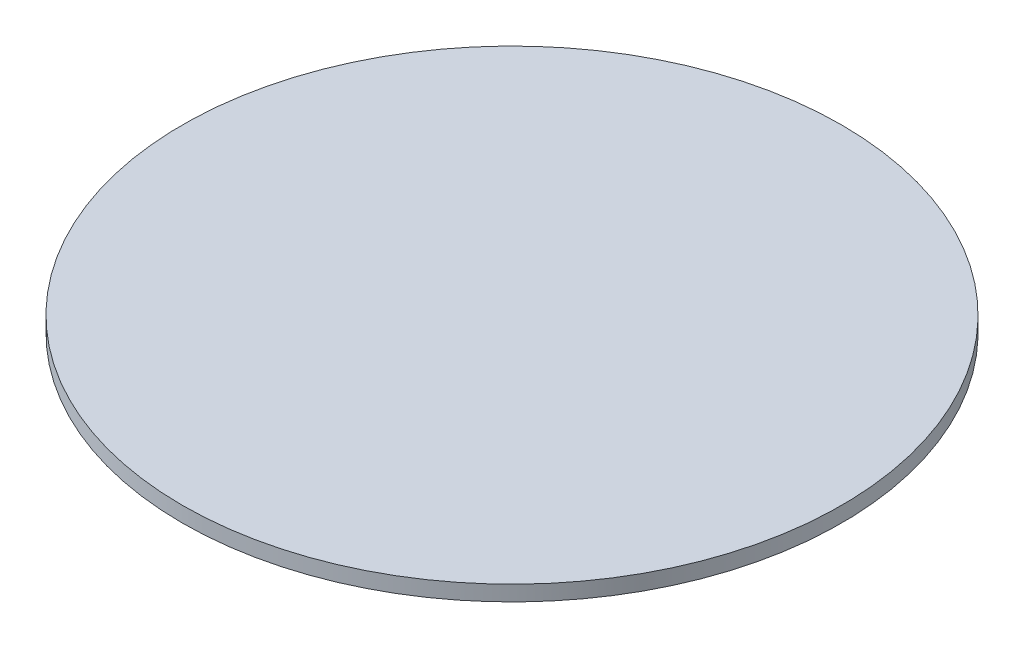
ISO-10303-21;
HEADER;
FILE_DESCRIPTION(('STEP AP214'),'2;1');
FILE_NAME('part.step','',(''),(''),'','','');
FILE_SCHEMA(('AUTOMOTIVE_DESIGN { 1 0 10303 214 1 1 1 1 }'));
ENDSEC;
DATA;
#1=APPLICATION_CONTEXT('core data for automotive mechanical design processes');
#2=APPLICATION_PROTOCOL_DEFINITION('international standard','automotive_design',2000,#1);
#3=PRODUCT_CONTEXT('',#1,'mechanical');
#4=PRODUCT('Part','Part','',(#3));
#5=PRODUCT_RELATED_PRODUCT_CATEGORY('part','',(#4));
#6=PRODUCT_DEFINITION_FORMATION('','',#4);
#7=PRODUCT_DEFINITION_CONTEXT('part definition',#1,'design');
#8=PRODUCT_DEFINITION('design','',#6,#7);
#9=PRODUCT_DEFINITION_SHAPE('','',#8);
#10=(LENGTH_UNIT() NAMED_UNIT(*) SI_UNIT(.MILLI.,.METRE.));
#11=(NAMED_UNIT(*) PLANE_ANGLE_UNIT() SI_UNIT($,.RADIAN.));
#12=(NAMED_UNIT(*) SI_UNIT($,.STERADIAN.) SOLID_ANGLE_UNIT());
#13=UNCERTAINTY_MEASURE_WITH_UNIT(LENGTH_MEASURE(1.E-05),#10,'distance_accuracy_value','');
#14=(GEOMETRIC_REPRESENTATION_CONTEXT(3) GLOBAL_UNCERTAINTY_ASSIGNED_CONTEXT((#13)) GLOBAL_UNIT_ASSIGNED_CONTEXT((#10,
#11,#12)) REPRESENTATION_CONTEXT('',''));
#15=CARTESIAN_POINT('',(0.,0.,0.));
#16=DIRECTION('',(0.,0.,1.));
#17=DIRECTION('',(1.,0.,0.));
#18=AXIS2_PLACEMENT_3D('',#15,#16,#17);
#19=CARTESIAN_POINT('',(0.,7.,0.));
#20=DIRECTION('',(0.,-1.,0.));
#21=DIRECTION('',(0.,0.,-1.));
#22=AXIS2_PLACEMENT_3D('',#19,#20,#21);
#23=CYLINDRICAL_SURFACE('',#22,150.);
#24=CARTESIAN_POINT('',(0.,7.,0.));
#25=DIRECTION('',(0.,1.,0.));
#26=DIRECTION('',(0.,0.,1.));
#27=AXIS2_PLACEMENT_3D('',#24,#25,#26);
#28=CIRCLE('',#27,150.);
#29=CARTESIAN_POINT('',(0.,7.,150.));
#30=VERTEX_POINT('',#29);
#31=EDGE_CURVE('E10',#30,#30,#28,.T.);
#32=ORIENTED_EDGE('',*,*,#31,.F.);
#33=EDGE_LOOP('',(#32));
#34=FACE_BOUND('',#33,.T.);
#35=CARTESIAN_POINT('',(0.,0.,0.));
#36=DIRECTION('',(0.,1.,0.));
#37=DIRECTION('',(0.,0.,1.));
#38=AXIS2_PLACEMENT_3D('',#35,#36,#37);
#39=CIRCLE('',#38,150.);
#40=CARTESIAN_POINT('',(0.,0.,150.));
#41=VERTEX_POINT('',#40);
#42=EDGE_CURVE('E40',#41,#41,#39,.T.);
#43=ORIENTED_EDGE('',*,*,#42,.T.);
#44=EDGE_LOOP('',(#43));
#45=FACE_BOUND('',#44,.T.);
#46=ADVANCED_FACE('F37',(#34,#45),#23,.T.);
#47=CARTESIAN_POINT('',(0.,7.,0.));
#48=DIRECTION('',(0.,1.,0.));
#49=DIRECTION('',(0.,0.,1.));
#50=AXIS2_PLACEMENT_3D('',#47,#48,#49);
#51=PLANE('',#50);
#52=ORIENTED_EDGE('',*,*,#31,.T.);
#53=EDGE_LOOP('',(#52));
#54=FACE_BOUND('',#53,.T.);
#55=ADVANCED_FACE('F54',(#54),#51,.T.);
#56=CARTESIAN_POINT('',(0.,0.,0.));
#57=DIRECTION('',(0.,1.,0.));
#58=DIRECTION('',(0.,0.,1.));
#59=AXIS2_PLACEMENT_3D('',#56,#57,#58);
#60=PLANE('',#59);
#61=ORIENTED_EDGE('',*,*,#42,.F.);
#62=EDGE_LOOP('',(#61));
#63=FACE_BOUND('',#62,.T.);
#64=ADVANCED_FACE('F52',(#63),#60,.F.);
#65=CLOSED_SHELL('',(#46,#55,#64));
#66=MANIFOLD_SOLID_BREP('B2',#65);
#67=ADVANCED_BREP_SHAPE_REPRESENTATION('',(#18,#66),#14);
#68=SHAPE_DEFINITION_REPRESENTATION(#9,#67);
ENDSEC;
END-ISO-10303-21;
